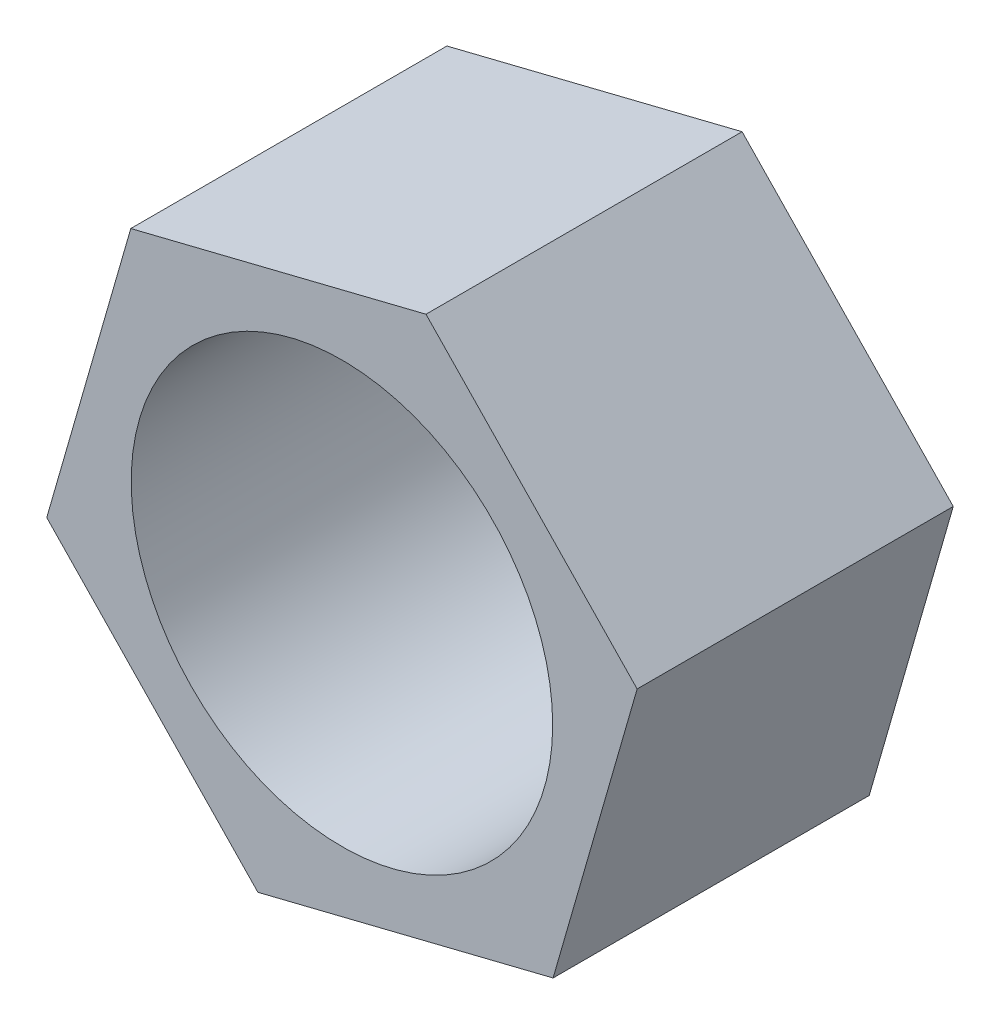
ISO-10303-21;
HEADER;
FILE_DESCRIPTION(('STEP AP214'),'2;1');
FILE_NAME('part.step','',(''),(''),'','','');
FILE_SCHEMA(('AUTOMOTIVE_DESIGN { 1 0 10303 214 1 1 1 1 }'));
ENDSEC;
DATA;
#1=APPLICATION_CONTEXT('core data for automotive mechanical design processes');
#2=APPLICATION_PROTOCOL_DEFINITION('international standard','automotive_design',2000,#1);
#3=PRODUCT_CONTEXT('',#1,'mechanical');
#4=PRODUCT('Part','Part','',(#3));
#5=PRODUCT_RELATED_PRODUCT_CATEGORY('part','',(#4));
#6=PRODUCT_DEFINITION_FORMATION('','',#4);
#7=PRODUCT_DEFINITION_CONTEXT('part definition',#1,'design');
#8=PRODUCT_DEFINITION('design','',#6,#7);
#9=PRODUCT_DEFINITION_SHAPE('','',#8);
#10=(LENGTH_UNIT() NAMED_UNIT(*) SI_UNIT(.MILLI.,.METRE.));
#11=(NAMED_UNIT(*) PLANE_ANGLE_UNIT() SI_UNIT($,.RADIAN.));
#12=(NAMED_UNIT(*) SI_UNIT($,.STERADIAN.) SOLID_ANGLE_UNIT());
#13=UNCERTAINTY_MEASURE_WITH_UNIT(LENGTH_MEASURE(1.E-05),#10,'distance_accuracy_value','');
#14=(GEOMETRIC_REPRESENTATION_CONTEXT(3) GLOBAL_UNCERTAINTY_ASSIGNED_CONTEXT((#13)) GLOBAL_UNIT_ASSIGNED_CONTEXT((#10,
#11,#12)) REPRESENTATION_CONTEXT('',''));
#15=CARTESIAN_POINT('',(0.,0.,0.));
#16=DIRECTION('',(0.,0.,1.));
#17=DIRECTION('',(1.,0.,0.));
#18=AXIS2_PLACEMENT_3D('',#15,#16,#17);
#19=CARTESIAN_POINT('',(0.,0.,3.));
#20=DIRECTION('',(0.,0.,1.));
#21=DIRECTION('',(1.,0.,0.));
#22=AXIS2_PLACEMENT_3D('',#19,#20,#21);
#23=PLANE('',#22);
#24=DIRECTION('',(0.970471231895738,0.241216890086017,0.));
#25=VECTOR('',#24,1.);
#26=CARTESIAN_POINT('',(-0.797712342224439,-2.77434467079996,3.));
#27=LINE('',#26,#25);
#28=CARTESIAN_POINT('',(-0.797712342224439,-2.77434467079996,3.));
#29=VERTEX_POINT('',#28);
#30=CARTESIAN_POINT('',(2.00379679265452,-2.07801148867873,3.));
#31=VERTEX_POINT('',#30);
#32=EDGE_CURVE('E146',#29,#31,#27,.T.);
#33=ORIENTED_EDGE('',*,*,#32,.T.);
#34=DIRECTION('',(0.2763356613115,0.961061185506696,0.));
#35=VECTOR('',#34,1.);
#36=CARTESIAN_POINT('',(2.00379679265452,-2.07801148867873,3.));
#37=LINE('',#36,#35);
#38=CARTESIAN_POINT('',(2.80150913487896,0.696333182121231,3.));
#39=VERTEX_POINT('',#38);
#40=EDGE_CURVE('E94',#31,#39,#37,.T.);
#41=ORIENTED_EDGE('',*,*,#40,.T.);
#42=DIRECTION('',(-0.694135570584238,0.71984429542068,0.));
#43=VECTOR('',#42,1.);
#44=CARTESIAN_POINT('',(2.80150913487896,0.696333182121231,3.));
#45=LINE('',#44,#43);
#46=CARTESIAN_POINT('',(0.797712342224439,2.77434467079996,3.));
#47=VERTEX_POINT('',#46);
#48=EDGE_CURVE('E107',#39,#47,#45,.T.);
#49=ORIENTED_EDGE('',*,*,#48,.T.);
#50=DIRECTION('',(-0.970471231895738,-0.241216890086016,0.));
#51=VECTOR('',#50,1.);
#52=CARTESIAN_POINT('',(0.797712342224439,2.77434467079996,3.));
#53=LINE('',#52,#51);
#54=CARTESIAN_POINT('',(-2.00379679265452,2.07801148867873,3.));
#55=VERTEX_POINT('',#54);
#56=EDGE_CURVE('E101',#47,#55,#53,.T.);
#57=ORIENTED_EDGE('',*,*,#56,.T.);
#58=DIRECTION('',(-0.2763356613115,-0.961061185506696,0.));
#59=VECTOR('',#58,1.);
#60=CARTESIAN_POINT('',(-2.00379679265452,2.07801148867873,3.));
#61=LINE('',#60,#59);
#62=CARTESIAN_POINT('',(-2.80150913487896,-0.696333182121231,3.));
#63=VERTEX_POINT('',#62);
#64=EDGE_CURVE('E105',#55,#63,#61,.T.);
#65=ORIENTED_EDGE('',*,*,#64,.T.);
#66=DIRECTION('',(0.694135570584238,-0.71984429542068,0.));
#67=VECTOR('',#66,1.);
#68=CARTESIAN_POINT('',(-2.80150913487896,-0.696333182121231,3.));
#69=LINE('',#68,#67);
#70=EDGE_CURVE('E57',#63,#29,#69,.T.);
#71=ORIENTED_EDGE('',*,*,#70,.T.);
#72=EDGE_LOOP('',(#33,#41,#49,#57,#65,#71));
#73=FACE_BOUND('',#72,.T.);
#74=CARTESIAN_POINT('',(0.,0.,3.));
#75=DIRECTION('',(0.,0.,1.));
#76=DIRECTION('',(1.,0.,0.));
#77=AXIS2_PLACEMENT_3D('',#74,#75,#76);
#78=CIRCLE('',#77,2.);
#79=CARTESIAN_POINT('',(2.,0.,3.));
#80=VERTEX_POINT('',#79);
#81=EDGE_CURVE('E134',#80,#80,#78,.T.);
#82=ORIENTED_EDGE('',*,*,#81,.F.);
#83=EDGE_LOOP('',(#82));
#84=FACE_BOUND('',#83,.T.);
#85=ADVANCED_FACE('F39',(#73,#84),#23,.T.);
#86=CARTESIAN_POINT('',(0.,0.,0.));
#87=DIRECTION('',(0.,0.,1.));
#88=DIRECTION('',(1.,0.,0.));
#89=AXIS2_PLACEMENT_3D('',#86,#87,#88);
#90=PLANE('',#89);
#91=DIRECTION('',(0.970471231895738,0.241216890086017,0.));
#92=VECTOR('',#91,1.);
#93=CARTESIAN_POINT('',(-0.797712342224439,-2.77434467079996,0.));
#94=LINE('',#93,#92);
#95=CARTESIAN_POINT('',(-0.797712342224439,-2.77434467079996,0.));
#96=VERTEX_POINT('',#95);
#97=CARTESIAN_POINT('',(2.00379679265452,-2.07801148867873,0.));
#98=VERTEX_POINT('',#97);
#99=EDGE_CURVE('E129',#96,#98,#94,.T.);
#100=ORIENTED_EDGE('',*,*,#99,.F.);
#101=DIRECTION('',(0.694135570584238,-0.71984429542068,0.));
#102=VECTOR('',#101,1.);
#103=CARTESIAN_POINT('',(-2.80150913487896,-0.696333182121231,0.));
#104=LINE('',#103,#102);
#105=CARTESIAN_POINT('',(-2.80150913487896,-0.696333182121231,0.));
#106=VERTEX_POINT('',#105);
#107=EDGE_CURVE('E86',#106,#96,#104,.T.);
#108=ORIENTED_EDGE('',*,*,#107,.F.);
#109=DIRECTION('',(-0.2763356613115,-0.961061185506696,0.));
#110=VECTOR('',#109,1.);
#111=CARTESIAN_POINT('',(-2.00379679265452,2.07801148867873,0.));
#112=LINE('',#111,#110);
#113=CARTESIAN_POINT('',(-2.00379679265452,2.07801148867873,0.));
#114=VERTEX_POINT('',#113);
#115=EDGE_CURVE('E80',#114,#106,#112,.T.);
#116=ORIENTED_EDGE('',*,*,#115,.F.);
#117=DIRECTION('',(-0.970471231895738,-0.241216890086016,0.));
#118=VECTOR('',#117,1.);
#119=CARTESIAN_POINT('',(0.797712342224439,2.77434467079996,0.));
#120=LINE('',#119,#118);
#121=CARTESIAN_POINT('',(0.797712342224439,2.77434467079996,0.));
#122=VERTEX_POINT('',#121);
#123=EDGE_CURVE('E116',#122,#114,#120,.T.);
#124=ORIENTED_EDGE('',*,*,#123,.F.);
#125=DIRECTION('',(-0.694135570584238,0.71984429542068,0.));
#126=VECTOR('',#125,1.);
#127=CARTESIAN_POINT('',(2.80150913487896,0.696333182121231,0.));
#128=LINE('',#127,#126);
#129=CARTESIAN_POINT('',(2.80150913487896,0.696333182121231,0.));
#130=VERTEX_POINT('',#129);
#131=EDGE_CURVE('E137',#130,#122,#128,.T.);
#132=ORIENTED_EDGE('',*,*,#131,.F.);
#133=DIRECTION('',(0.2763356613115,0.961061185506696,0.));
#134=VECTOR('',#133,1.);
#135=CARTESIAN_POINT('',(2.00379679265452,-2.07801148867873,0.));
#136=LINE('',#135,#134);
#137=EDGE_CURVE('E133',#98,#130,#136,.T.);
#138=ORIENTED_EDGE('',*,*,#137,.F.);
#139=EDGE_LOOP('',(#100,#108,#116,#124,#132,#138));
#140=FACE_BOUND('',#139,.T.);
#141=CARTESIAN_POINT('',(0.,0.,0.));
#142=DIRECTION('',(0.,0.,1.));
#143=DIRECTION('',(1.,0.,0.));
#144=AXIS2_PLACEMENT_3D('',#141,#142,#143);
#145=CIRCLE('',#144,2.);
#146=CARTESIAN_POINT('',(2.,0.,0.));
#147=VERTEX_POINT('',#146);
#148=EDGE_CURVE('E243',#147,#147,#145,.T.);
#149=ORIENTED_EDGE('',*,*,#148,.T.);
#150=EDGE_LOOP('',(#149));
#151=FACE_BOUND('',#150,.T.);
#152=ADVANCED_FACE('F159',(#140,#151),#90,.F.);
#153=CARTESIAN_POINT('',(-0.797712342224439,-2.77434467079996,3.));
#154=DIRECTION('',(-0.241216890086017,0.970471231895738,0.));
#155=DIRECTION('',(-0.970471231895738,-0.241216890086017,0.));
#156=AXIS2_PLACEMENT_3D('',#153,#154,#155);
#157=PLANE('',#156);
#158=ORIENTED_EDGE('',*,*,#99,.T.);
#159=DIRECTION('',(0.,0.,-1.));
#160=VECTOR('',#159,1.);
#161=CARTESIAN_POINT('',(2.00379679265452,-2.07801148867873,3.));
#162=LINE('',#161,#160);
#163=EDGE_CURVE('E11',#31,#98,#162,.T.);
#164=ORIENTED_EDGE('',*,*,#163,.F.);
#165=ORIENTED_EDGE('',*,*,#32,.F.);
#166=DIRECTION('',(0.,0.,-1.));
#167=VECTOR('',#166,1.);
#168=CARTESIAN_POINT('',(-0.797712342224439,-2.77434467079996,3.));
#169=LINE('',#168,#167);
#170=EDGE_CURVE('E125',#29,#96,#169,.T.);
#171=ORIENTED_EDGE('',*,*,#170,.T.);
#172=EDGE_LOOP('',(#158,#164,#165,#171));
#173=FACE_BOUND('',#172,.T.);
#174=ADVANCED_FACE('F41',(#173),#157,.F.);
#175=CARTESIAN_POINT('',(2.00379679265452,-2.07801148867873,3.));
#176=DIRECTION('',(-0.961061185506696,0.2763356613115,0.));
#177=DIRECTION('',(-0.2763356613115,-0.961061185506696,0.));
#178=AXIS2_PLACEMENT_3D('',#175,#176,#177);
#179=PLANE('',#178);
#180=ORIENTED_EDGE('',*,*,#137,.T.);
#181=DIRECTION('',(0.,0.,-1.));
#182=VECTOR('',#181,1.);
#183=CARTESIAN_POINT('',(2.80150913487896,0.696333182121231,3.));
#184=LINE('',#183,#182);
#185=EDGE_CURVE('E49',#39,#130,#184,.T.);
#186=ORIENTED_EDGE('',*,*,#185,.F.);
#187=ORIENTED_EDGE('',*,*,#40,.F.);
#188=ORIENTED_EDGE('',*,*,#163,.T.);
#189=EDGE_LOOP('',(#180,#186,#187,#188));
#190=FACE_BOUND('',#189,.T.);
#191=ADVANCED_FACE('F184',(#190),#179,.F.);
#192=CARTESIAN_POINT('',(2.80150913487896,0.696333182121231,3.));
#193=DIRECTION('',(-0.719844295420679,-0.694135570584238,0.));
#194=DIRECTION('',(0.694135570584238,-0.71984429542068,0.));
#195=AXIS2_PLACEMENT_3D('',#192,#193,#194);
#196=PLANE('',#195);
#197=ORIENTED_EDGE('',*,*,#131,.T.);
#198=DIRECTION('',(0.,0.,-1.));
#199=VECTOR('',#198,1.);
#200=CARTESIAN_POINT('',(0.797712342224439,2.77434467079996,3.));
#201=LINE('',#200,#199);
#202=EDGE_CURVE('E118',#47,#122,#201,.T.);
#203=ORIENTED_EDGE('',*,*,#202,.F.);
#204=ORIENTED_EDGE('',*,*,#48,.F.);
#205=ORIENTED_EDGE('',*,*,#185,.T.);
#206=EDGE_LOOP('',(#197,#203,#204,#205));
#207=FACE_BOUND('',#206,.T.);
#208=ADVANCED_FACE('F156',(#207),#196,.F.);
#209=CARTESIAN_POINT('',(0.797712342224439,2.77434467079996,3.));
#210=DIRECTION('',(0.241216890086016,-0.970471231895738,0.));
#211=DIRECTION('',(0.970471231895738,0.241216890086016,0.));
#212=AXIS2_PLACEMENT_3D('',#209,#210,#211);
#213=PLANE('',#212);
#214=ORIENTED_EDGE('',*,*,#123,.T.);
#215=DIRECTION('',(0.,0.,-1.));
#216=VECTOR('',#215,1.);
#217=CARTESIAN_POINT('',(-2.00379679265452,2.07801148867873,3.));
#218=LINE('',#217,#216);
#219=EDGE_CURVE('E113',#55,#114,#218,.T.);
#220=ORIENTED_EDGE('',*,*,#219,.F.);
#221=ORIENTED_EDGE('',*,*,#56,.F.);
#222=ORIENTED_EDGE('',*,*,#202,.T.);
#223=EDGE_LOOP('',(#214,#220,#221,#222));
#224=FACE_BOUND('',#223,.T.);
#225=ADVANCED_FACE('F114',(#224),#213,.F.);
#226=CARTESIAN_POINT('',(-2.00379679265452,2.07801148867873,3.));
#227=DIRECTION('',(0.961061185506696,-0.2763356613115,0.));
#228=DIRECTION('',(0.2763356613115,0.961061185506696,0.));
#229=AXIS2_PLACEMENT_3D('',#226,#227,#228);
#230=PLANE('',#229);
#231=ORIENTED_EDGE('',*,*,#115,.T.);
#232=DIRECTION('',(0.,0.,-1.));
#233=VECTOR('',#232,1.);
#234=CARTESIAN_POINT('',(-2.80150913487896,-0.696333182121231,3.));
#235=LINE('',#234,#233);
#236=EDGE_CURVE('E119',#63,#106,#235,.T.);
#237=ORIENTED_EDGE('',*,*,#236,.F.);
#238=ORIENTED_EDGE('',*,*,#64,.F.);
#239=ORIENTED_EDGE('',*,*,#219,.T.);
#240=EDGE_LOOP('',(#231,#237,#238,#239));
#241=FACE_BOUND('',#240,.T.);
#242=ADVANCED_FACE('F121',(#241),#230,.F.);
#243=CARTESIAN_POINT('',(-2.80150913487896,-0.696333182121231,3.));
#244=DIRECTION('',(0.71984429542068,0.694135570584238,0.));
#245=DIRECTION('',(-0.694135570584238,0.71984429542068,0.));
#246=AXIS2_PLACEMENT_3D('',#243,#244,#245);
#247=PLANE('',#246);
#248=ORIENTED_EDGE('',*,*,#107,.T.);
#249=ORIENTED_EDGE('',*,*,#170,.F.);
#250=ORIENTED_EDGE('',*,*,#70,.F.);
#251=ORIENTED_EDGE('',*,*,#236,.T.);
#252=EDGE_LOOP('',(#248,#249,#250,#251));
#253=FACE_BOUND('',#252,.T.);
#254=ADVANCED_FACE('F164',(#253),#247,.F.);
#255=CARTESIAN_POINT('',(0.,0.,3.));
#256=DIRECTION('',(0.,0.,-1.));
#257=DIRECTION('',(-1.,0.,0.));
#258=AXIS2_PLACEMENT_3D('',#255,#256,#257);
#259=CYLINDRICAL_SURFACE('',#258,2.);
#260=ORIENTED_EDGE('',*,*,#81,.T.);
#261=EDGE_LOOP('',(#260));
#262=FACE_BOUND('',#261,.T.);
#263=ORIENTED_EDGE('',*,*,#148,.F.);
#264=EDGE_LOOP('',(#263));
#265=FACE_BOUND('',#264,.T.);
#266=ADVANCED_FACE('F166',(#262,#265),#259,.F.);
#267=CLOSED_SHELL('',(#85,#152,#174,#191,#208,#225,#242,#254,#266));
#268=MANIFOLD_SOLID_BREP('B2',#267);
#269=ADVANCED_BREP_SHAPE_REPRESENTATION('',(#18,#268),#14);
#270=SHAPE_DEFINITION_REPRESENTATION(#9,#269);
ENDSEC;
END-ISO-10303-21;
